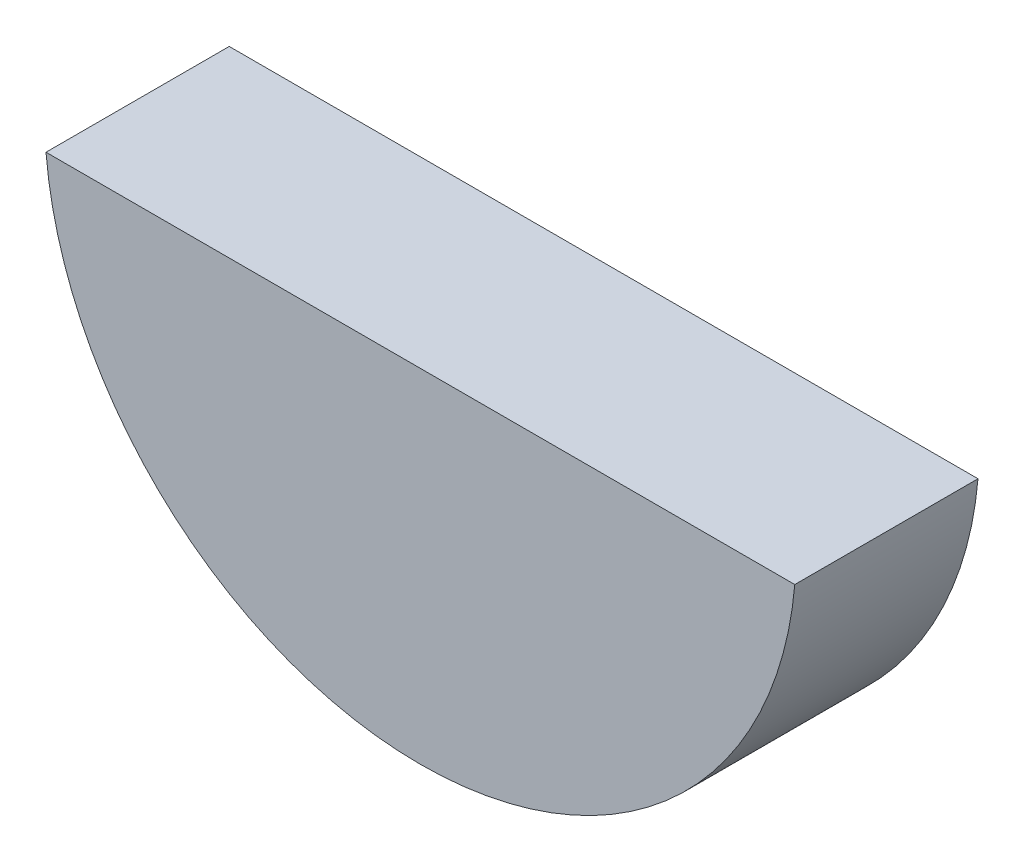
ISO-10303-21;
HEADER;
FILE_DESCRIPTION(('STEP AP214'),'2;1');
FILE_NAME('part.step','',(''),(''),'','','');
FILE_SCHEMA(('AUTOMOTIVE_DESIGN { 1 0 10303 214 1 1 1 1 }'));
ENDSEC;
DATA;
#1=APPLICATION_CONTEXT('core data for automotive mechanical design processes');
#2=APPLICATION_PROTOCOL_DEFINITION('international standard','automotive_design',2000,#1);
#3=PRODUCT_CONTEXT('',#1,'mechanical');
#4=PRODUCT('Part','Part','',(#3));
#5=PRODUCT_RELATED_PRODUCT_CATEGORY('part','',(#4));
#6=PRODUCT_DEFINITION_FORMATION('','',#4);
#7=PRODUCT_DEFINITION_CONTEXT('part definition',#1,'design');
#8=PRODUCT_DEFINITION('design','',#6,#7);
#9=PRODUCT_DEFINITION_SHAPE('','',#8);
#10=(LENGTH_UNIT() NAMED_UNIT(*) SI_UNIT(.MILLI.,.METRE.));
#11=(NAMED_UNIT(*) PLANE_ANGLE_UNIT() SI_UNIT($,.RADIAN.));
#12=(NAMED_UNIT(*) SI_UNIT($,.STERADIAN.) SOLID_ANGLE_UNIT());
#13=UNCERTAINTY_MEASURE_WITH_UNIT(LENGTH_MEASURE(1.E-05),#10,'distance_accuracy_value','');
#14=(GEOMETRIC_REPRESENTATION_CONTEXT(3) GLOBAL_UNCERTAINTY_ASSIGNED_CONTEXT((#13)) GLOBAL_UNIT_ASSIGNED_CONTEXT((#10,
#11,#12)) REPRESENTATION_CONTEXT('',''));
#15=CARTESIAN_POINT('',(0.,0.,0.));
#16=DIRECTION('',(0.,0.,1.));
#17=DIRECTION('',(1.,0.,0.));
#18=AXIS2_PLACEMENT_3D('',#15,#16,#17);
#19=CARTESIAN_POINT('',(0.,0.,3.9));
#20=DIRECTION('',(0.,0.,-1.));
#21=DIRECTION('',(-1.,0.,0.));
#22=AXIS2_PLACEMENT_3D('',#19,#20,#21);
#23=CYLINDRICAL_SURFACE('',#22,8.);
#24=DIRECTION('',(0.,0.,-1.));
#25=VECTOR('',#24,1.);
#26=CARTESIAN_POINT('',(7.96931615635871,-0.7,3.9));
#27=LINE('',#26,#25);
#28=CARTESIAN_POINT('',(7.96931615635871,-0.7,3.9));
#29=VERTEX_POINT('',#28);
#30=CARTESIAN_POINT('',(7.96931615635871,-0.7,0.));
#31=VERTEX_POINT('',#30);
#32=EDGE_CURVE('E46',#29,#31,#27,.T.);
#33=ORIENTED_EDGE('',*,*,#32,.F.);
#34=CARTESIAN_POINT('',(0.,0.,3.9));
#35=DIRECTION('',(0.,0.,1.));
#36=DIRECTION('',(1.,0.,0.));
#37=AXIS2_PLACEMENT_3D('',#34,#35,#36);
#38=CIRCLE('',#37,8.);
#39=CARTESIAN_POINT('',(-7.96931615635871,-0.7,3.9));
#40=VERTEX_POINT('',#39);
#41=EDGE_CURVE('E40',#40,#29,#38,.T.);
#42=ORIENTED_EDGE('',*,*,#41,.F.);
#43=DIRECTION('',(0.,0.,-1.));
#44=VECTOR('',#43,1.);
#45=CARTESIAN_POINT('',(-7.96931615635871,-0.7,3.9));
#46=LINE('',#45,#44);
#47=CARTESIAN_POINT('',(-7.96931615635871,-0.7,0.));
#48=VERTEX_POINT('',#47);
#49=EDGE_CURVE('E54',#48,#40,#46,.F.);
#50=ORIENTED_EDGE('',*,*,#49,.F.);
#51=CARTESIAN_POINT('',(0.,0.,0.));
#52=DIRECTION('',(0.,0.,1.));
#53=DIRECTION('',(1.,0.,0.));
#54=AXIS2_PLACEMENT_3D('',#51,#52,#53);
#55=CIRCLE('',#54,8.);
#56=EDGE_CURVE('E67',#48,#31,#55,.T.);
#57=ORIENTED_EDGE('',*,*,#56,.T.);
#58=EDGE_LOOP('',(#33,#42,#50,#57));
#59=FACE_BOUND('',#58,.T.);
#60=ADVANCED_FACE('F33',(#59),#23,.T.);
#61=CARTESIAN_POINT('',(0.,0.,3.9));
#62=DIRECTION('',(0.,0.,1.));
#63=DIRECTION('',(1.,0.,0.));
#64=AXIS2_PLACEMENT_3D('',#61,#62,#63);
#65=PLANE('',#64);
#66=ORIENTED_EDGE('',*,*,#41,.T.);
#67=DIRECTION('',(1.,0.,0.));
#68=VECTOR('',#67,1.);
#69=CARTESIAN_POINT('',(-8.,-0.7,3.9));
#70=LINE('',#69,#68);
#71=EDGE_CURVE('E57',#40,#29,#70,.T.);
#72=ORIENTED_EDGE('',*,*,#71,.F.);
#73=EDGE_LOOP('',(#66,#72));
#74=FACE_BOUND('',#73,.T.);
#75=ADVANCED_FACE('F65',(#74),#65,.T.);
#76=CARTESIAN_POINT('',(0.,0.,0.));
#77=DIRECTION('',(0.,0.,1.));
#78=DIRECTION('',(1.,0.,0.));
#79=AXIS2_PLACEMENT_3D('',#76,#77,#78);
#80=PLANE('',#79);
#81=DIRECTION('',(-1.,0.,0.));
#82=VECTOR('',#81,1.);
#83=CARTESIAN_POINT('',(0.,-0.7,0.));
#84=LINE('',#83,#82);
#85=EDGE_CURVE('E11',#31,#48,#84,.T.);
#86=ORIENTED_EDGE('',*,*,#85,.F.);
#87=ORIENTED_EDGE('',*,*,#56,.F.);
#88=EDGE_LOOP('',(#86,#87));
#89=FACE_BOUND('',#88,.T.);
#90=ADVANCED_FACE('F71',(#89),#80,.F.);
#91=CARTESIAN_POINT('',(0.,-0.7,0.));
#92=DIRECTION('',(0.,1.,0.));
#93=DIRECTION('',(0.,0.,1.));
#94=AXIS2_PLACEMENT_3D('',#91,#92,#93);
#95=PLANE('',#94);
#96=ORIENTED_EDGE('',*,*,#32,.T.);
#97=ORIENTED_EDGE('',*,*,#85,.T.);
#98=ORIENTED_EDGE('',*,*,#49,.T.);
#99=ORIENTED_EDGE('',*,*,#71,.T.);
#100=EDGE_LOOP('',(#96,#97,#98,#99));
#101=FACE_BOUND('',#100,.T.);
#102=ADVANCED_FACE('F56',(#101),#95,.T.);
#103=CLOSED_SHELL('',(#60,#75,#90,#102));
#104=MANIFOLD_SOLID_BREP('B2',#103);
#105=ADVANCED_BREP_SHAPE_REPRESENTATION('',(#18,#104),#14);
#106=SHAPE_DEFINITION_REPRESENTATION(#9,#105);
ENDSEC;
END-ISO-10303-21;
